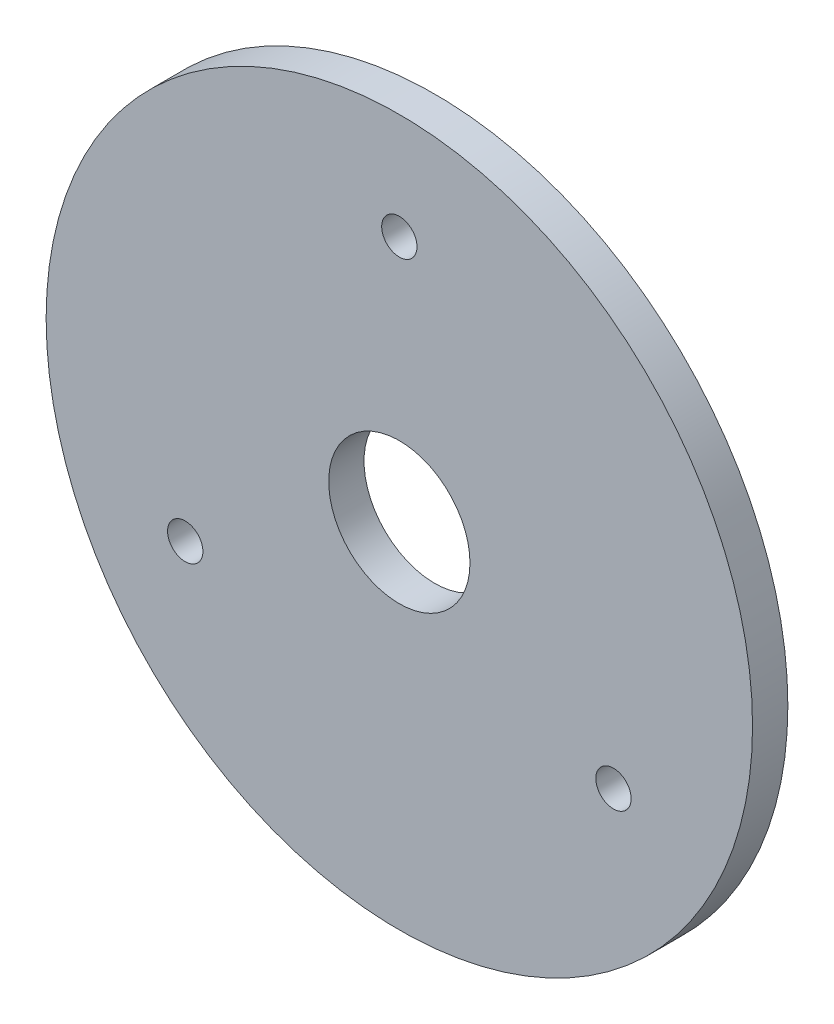
ISO-10303-21;
HEADER;
FILE_DESCRIPTION(('STEP AP214'),'2;1');
FILE_NAME('part.step','',(''),(''),'','','');
FILE_SCHEMA(('AUTOMOTIVE_DESIGN { 1 0 10303 214 1 1 1 1 }'));
ENDSEC;
DATA;
#1=APPLICATION_CONTEXT('core data for automotive mechanical design processes');
#2=APPLICATION_PROTOCOL_DEFINITION('international standard','automotive_design',2000,#1);
#3=PRODUCT_CONTEXT('',#1,'mechanical');
#4=PRODUCT('Part','Part','',(#3));
#5=PRODUCT_RELATED_PRODUCT_CATEGORY('part','',(#4));
#6=PRODUCT_DEFINITION_FORMATION('','',#4);
#7=PRODUCT_DEFINITION_CONTEXT('part definition',#1,'design');
#8=PRODUCT_DEFINITION('design','',#6,#7);
#9=PRODUCT_DEFINITION_SHAPE('','',#8);
#10=(LENGTH_UNIT() NAMED_UNIT(*) SI_UNIT(.MILLI.,.METRE.));
#11=(NAMED_UNIT(*) PLANE_ANGLE_UNIT() SI_UNIT($,.RADIAN.));
#12=(NAMED_UNIT(*) SI_UNIT($,.STERADIAN.) SOLID_ANGLE_UNIT());
#13=UNCERTAINTY_MEASURE_WITH_UNIT(LENGTH_MEASURE(1.E-05),#10,'distance_accuracy_value','');
#14=(GEOMETRIC_REPRESENTATION_CONTEXT(3) GLOBAL_UNCERTAINTY_ASSIGNED_CONTEXT((#13)) GLOBAL_UNIT_ASSIGNED_CONTEXT((#10,
#11,#12)) REPRESENTATION_CONTEXT('',''));
#15=CARTESIAN_POINT('',(0.,0.,0.));
#16=DIRECTION('',(0.,0.,1.));
#17=DIRECTION('',(1.,0.,0.));
#18=AXIS2_PLACEMENT_3D('',#15,#16,#17);
#19=CARTESIAN_POINT('',(0.,0.,-2.));
#20=DIRECTION('',(0.,0.,1.));
#21=DIRECTION('',(-1.,0.,0.));
#22=AXIS2_PLACEMENT_3D('',#19,#20,#21);
#23=CYLINDRICAL_SURFACE('',#22,20.);
#24=CARTESIAN_POINT('',(0.,0.,-2.));
#25=DIRECTION('',(0.,0.,1.));
#26=DIRECTION('',(1.,0.,0.));
#27=AXIS2_PLACEMENT_3D('',#24,#25,#26);
#28=CIRCLE('',#27,20.);
#29=CARTESIAN_POINT('',(20.,0.,-2.));
#30=VERTEX_POINT('',#29);
#31=EDGE_CURVE('E10',#30,#30,#28,.T.);
#32=ORIENTED_EDGE('',*,*,#31,.T.);
#33=EDGE_LOOP('',(#32));
#34=FACE_BOUND('',#33,.T.);
#35=CARTESIAN_POINT('',(0.,0.,0.));
#36=DIRECTION('',(0.,0.,1.));
#37=DIRECTION('',(1.,0.,0.));
#38=AXIS2_PLACEMENT_3D('',#35,#36,#37);
#39=CIRCLE('',#38,20.);
#40=CARTESIAN_POINT('',(20.,0.,0.));
#41=VERTEX_POINT('',#40);
#42=EDGE_CURVE('E38',#41,#41,#39,.T.);
#43=ORIENTED_EDGE('',*,*,#42,.F.);
#44=EDGE_LOOP('',(#43));
#45=FACE_BOUND('',#44,.T.);
#46=ADVANCED_FACE('F35',(#34,#45),#23,.T.);
#47=CARTESIAN_POINT('',(0.,0.,-2.));
#48=DIRECTION('',(0.,0.,-1.));
#49=DIRECTION('',(1.,0.,0.));
#50=AXIS2_PLACEMENT_3D('',#47,#48,#49);
#51=PLANE('',#50);
#52=CARTESIAN_POINT('',(0.,0.,-2.));
#53=DIRECTION('',(0.,0.,1.));
#54=DIRECTION('',(1.,0.,0.));
#55=AXIS2_PLACEMENT_3D('',#52,#53,#54);
#56=CIRCLE('',#55,4.);
#57=CARTESIAN_POINT('',(4.,0.,-2.));
#58=VERTEX_POINT('',#57);
#59=EDGE_CURVE('E65',#58,#58,#56,.T.);
#60=ORIENTED_EDGE('',*,*,#59,.T.);
#61=EDGE_LOOP('',(#60));
#62=FACE_BOUND('',#61,.T.);
#63=CARTESIAN_POINT('',(12.1243556529822,-6.99999999999989,-2.));
#64=DIRECTION('',(0.,0.,1.));
#65=DIRECTION('',(-0.499999999999992,-0.866025403784443,0.));
#66=AXIS2_PLACEMENT_3D('',#63,#64,#65);
#67=CIRCLE('',#66,1.);
#68=CARTESIAN_POINT('',(11.6243556529822,-7.86602540378433,-2.));
#69=VERTEX_POINT('',#68);
#70=EDGE_CURVE('E59',#69,#69,#67,.T.);
#71=ORIENTED_EDGE('',*,*,#70,.T.);
#72=EDGE_LOOP('',(#71));
#73=FACE_BOUND('',#72,.T.);
#74=CARTESIAN_POINT('',(-12.1243556529821,-7.00000000000006,-2.));
#75=DIRECTION('',(0.,0.,1.));
#76=DIRECTION('',(-0.500000000000004,0.866025403784436,0.));
#77=AXIS2_PLACEMENT_3D('',#74,#75,#76);
#78=CIRCLE('',#77,1.);
#79=CARTESIAN_POINT('',(-12.6243556529821,-6.13397459621562,-2.));
#80=VERTEX_POINT('',#79);
#81=EDGE_CURVE('E53',#80,#80,#78,.T.);
#82=ORIENTED_EDGE('',*,*,#81,.T.);
#83=EDGE_LOOP('',(#82));
#84=FACE_BOUND('',#83,.T.);
#85=CARTESIAN_POINT('',(0.,14.,-2.));
#86=DIRECTION('',(0.,0.,1.));
#87=DIRECTION('',(1.,0.,0.));
#88=AXIS2_PLACEMENT_3D('',#85,#86,#87);
#89=CIRCLE('',#88,1.);
#90=CARTESIAN_POINT('',(1.,14.,-2.));
#91=VERTEX_POINT('',#90);
#92=EDGE_CURVE('E47',#91,#91,#89,.T.);
#93=ORIENTED_EDGE('',*,*,#92,.T.);
#94=EDGE_LOOP('',(#93));
#95=FACE_BOUND('',#94,.T.);
#96=ORIENTED_EDGE('',*,*,#31,.F.);
#97=EDGE_LOOP('',(#96));
#98=FACE_BOUND('',#97,.T.);
#99=ADVANCED_FACE('F78',(#62,#73,#84,#95,#98),#51,.T.);
#100=CARTESIAN_POINT('',(0.,0.,0.));
#101=DIRECTION('',(0.,0.,-1.));
#102=DIRECTION('',(1.,0.,0.));
#103=AXIS2_PLACEMENT_3D('',#100,#101,#102);
#104=PLANE('',#103);
#105=CARTESIAN_POINT('',(0.,0.,0.));
#106=DIRECTION('',(0.,0.,1.));
#107=DIRECTION('',(1.,0.,0.));
#108=AXIS2_PLACEMENT_3D('',#105,#106,#107);
#109=CIRCLE('',#108,4.);
#110=CARTESIAN_POINT('',(4.,0.,0.));
#111=VERTEX_POINT('',#110);
#112=EDGE_CURVE('E62',#111,#111,#109,.T.);
#113=ORIENTED_EDGE('',*,*,#112,.F.);
#114=EDGE_LOOP('',(#113));
#115=FACE_BOUND('',#114,.T.);
#116=CARTESIAN_POINT('',(12.1243556529822,-6.99999999999989,0.));
#117=DIRECTION('',(0.,0.,1.));
#118=DIRECTION('',(-0.499999999999992,-0.866025403784443,0.));
#119=AXIS2_PLACEMENT_3D('',#116,#117,#118);
#120=CIRCLE('',#119,1.);
#121=CARTESIAN_POINT('',(11.6243556529822,-7.86602540378433,0.));
#122=VERTEX_POINT('',#121);
#123=EDGE_CURVE('E56',#122,#122,#120,.T.);
#124=ORIENTED_EDGE('',*,*,#123,.F.);
#125=EDGE_LOOP('',(#124));
#126=FACE_BOUND('',#125,.T.);
#127=CARTESIAN_POINT('',(-12.1243556529821,-7.00000000000006,0.));
#128=DIRECTION('',(0.,0.,1.));
#129=DIRECTION('',(-0.500000000000004,0.866025403784436,0.));
#130=AXIS2_PLACEMENT_3D('',#127,#128,#129);
#131=CIRCLE('',#130,1.);
#132=CARTESIAN_POINT('',(-12.6243556529821,-6.13397459621562,0.));
#133=VERTEX_POINT('',#132);
#134=EDGE_CURVE('E50',#133,#133,#131,.T.);
#135=ORIENTED_EDGE('',*,*,#134,.F.);
#136=EDGE_LOOP('',(#135));
#137=FACE_BOUND('',#136,.T.);
#138=CARTESIAN_POINT('',(0.,14.,0.));
#139=DIRECTION('',(0.,0.,1.));
#140=DIRECTION('',(1.,0.,0.));
#141=AXIS2_PLACEMENT_3D('',#138,#139,#140);
#142=CIRCLE('',#141,1.);
#143=CARTESIAN_POINT('',(1.,14.,0.));
#144=VERTEX_POINT('',#143);
#145=EDGE_CURVE('E45',#144,#144,#142,.T.);
#146=ORIENTED_EDGE('',*,*,#145,.F.);
#147=EDGE_LOOP('',(#146));
#148=FACE_BOUND('',#147,.T.);
#149=ORIENTED_EDGE('',*,*,#42,.T.);
#150=EDGE_LOOP('',(#149));
#151=FACE_BOUND('',#150,.T.);
#152=ADVANCED_FACE('F74',(#115,#126,#137,#148,#151),#104,.F.);
#153=CARTESIAN_POINT('',(0.,14.,0.));
#154=DIRECTION('',(0.,0.,-1.));
#155=DIRECTION('',(1.,0.,0.));
#156=AXIS2_PLACEMENT_3D('',#153,#154,#155);
#157=CYLINDRICAL_SURFACE('',#156,1.);
#158=ORIENTED_EDGE('',*,*,#145,.T.);
#159=EDGE_LOOP('',(#158));
#160=FACE_BOUND('',#159,.T.);
#161=ORIENTED_EDGE('',*,*,#92,.F.);
#162=EDGE_LOOP('',(#161));
#163=FACE_BOUND('',#162,.T.);
#164=ADVANCED_FACE('F77',(#160,#163),#157,.F.);
#165=CARTESIAN_POINT('',(-12.1243556529821,-7.00000000000006,0.));
#166=DIRECTION('',(0.,0.,-1.));
#167=DIRECTION('',(1.,0.,0.));
#168=AXIS2_PLACEMENT_3D('',#165,#166,#167);
#169=CYLINDRICAL_SURFACE('',#168,1.);
#170=ORIENTED_EDGE('',*,*,#134,.T.);
#171=EDGE_LOOP('',(#170));
#172=FACE_BOUND('',#171,.T.);
#173=ORIENTED_EDGE('',*,*,#81,.F.);
#174=EDGE_LOOP('',(#173));
#175=FACE_BOUND('',#174,.T.);
#176=ADVANCED_FACE('F99',(#172,#175),#169,.F.);
#177=CARTESIAN_POINT('',(12.1243556529822,-6.99999999999989,0.));
#178=DIRECTION('',(0.,0.,-1.));
#179=DIRECTION('',(1.,0.,0.));
#180=AXIS2_PLACEMENT_3D('',#177,#178,#179);
#181=CYLINDRICAL_SURFACE('',#180,1.);
#182=ORIENTED_EDGE('',*,*,#123,.T.);
#183=EDGE_LOOP('',(#182));
#184=FACE_BOUND('',#183,.T.);
#185=ORIENTED_EDGE('',*,*,#70,.F.);
#186=EDGE_LOOP('',(#185));
#187=FACE_BOUND('',#186,.T.);
#188=ADVANCED_FACE('F103',(#184,#187),#181,.F.);
#189=CARTESIAN_POINT('',(0.,0.,0.));
#190=DIRECTION('',(0.,0.,-1.));
#191=DIRECTION('',(1.,0.,0.));
#192=AXIS2_PLACEMENT_3D('',#189,#190,#191);
#193=CYLINDRICAL_SURFACE('',#192,4.);
#194=ORIENTED_EDGE('',*,*,#112,.T.);
#195=EDGE_LOOP('',(#194));
#196=FACE_BOUND('',#195,.T.);
#197=ORIENTED_EDGE('',*,*,#59,.F.);
#198=EDGE_LOOP('',(#197));
#199=FACE_BOUND('',#198,.T.);
#200=ADVANCED_FACE('F71',(#196,#199),#193,.F.);
#201=CLOSED_SHELL('',(#46,#99,#152,#164,#176,#188,#200));
#202=MANIFOLD_SOLID_BREP('B2',#201);
#203=ADVANCED_BREP_SHAPE_REPRESENTATION('',(#18,#202),#14);
#204=SHAPE_DEFINITION_REPRESENTATION(#9,#203);
ENDSEC;
END-ISO-10303-21;
